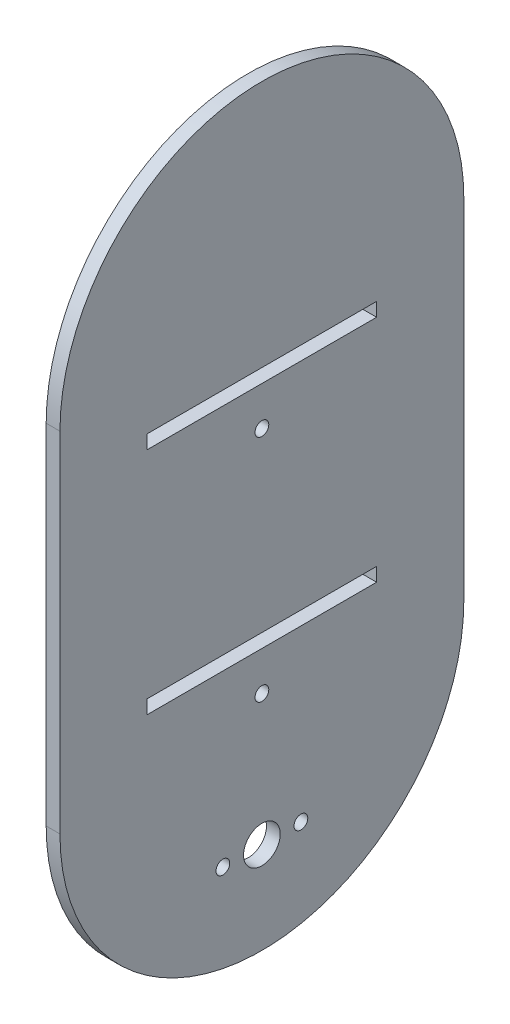
ISO-10303-21;
HEADER;
FILE_DESCRIPTION(('STEP AP214'),'2;1');
FILE_NAME('part.step','',(''),(''),'','','');
FILE_SCHEMA(('AUTOMOTIVE_DESIGN { 1 0 10303 214 1 1 1 1 }'));
ENDSEC;
DATA;
#1=APPLICATION_CONTEXT('core data for automotive mechanical design processes');
#2=APPLICATION_PROTOCOL_DEFINITION('international standard','automotive_design',2000,#1);
#3=PRODUCT_CONTEXT('',#1,'mechanical');
#4=PRODUCT('Part','Part','',(#3));
#5=PRODUCT_RELATED_PRODUCT_CATEGORY('part','',(#4));
#6=PRODUCT_DEFINITION_FORMATION('','',#4);
#7=PRODUCT_DEFINITION_CONTEXT('part definition',#1,'design');
#8=PRODUCT_DEFINITION('design','',#6,#7);
#9=PRODUCT_DEFINITION_SHAPE('','',#8);
#10=(LENGTH_UNIT() NAMED_UNIT(*) SI_UNIT(.MILLI.,.METRE.));
#11=(NAMED_UNIT(*) PLANE_ANGLE_UNIT() SI_UNIT($,.RADIAN.));
#12=(NAMED_UNIT(*) SI_UNIT($,.STERADIAN.) SOLID_ANGLE_UNIT());
#13=UNCERTAINTY_MEASURE_WITH_UNIT(LENGTH_MEASURE(1.E-05),#10,'distance_accuracy_value','');
#14=(GEOMETRIC_REPRESENTATION_CONTEXT(3) GLOBAL_UNCERTAINTY_ASSIGNED_CONTEXT((#13)) GLOBAL_UNIT_ASSIGNED_CONTEXT((#10,
#11,#12)) REPRESENTATION_CONTEXT('',''));
#15=CARTESIAN_POINT('',(0.,0.,0.));
#16=DIRECTION('',(0.,0.,1.));
#17=DIRECTION('',(1.,0.,0.));
#18=AXIS2_PLACEMENT_3D('',#15,#16,#17);
#19=CARTESIAN_POINT('',(3.,0.,0.));
#20=DIRECTION('',(1.,0.,0.));
#21=DIRECTION('',(0.,0.,-1.));
#22=AXIS2_PLACEMENT_3D('',#19,#20,#21);
#23=PLANE('',#22);
#24=CARTESIAN_POINT('',(3.,-100.,8.49999999999997));
#25=DIRECTION('',(1.,0.,0.));
#26=DIRECTION('',(0.,0.,-1.));
#27=AXIS2_PLACEMENT_3D('',#24,#25,#26);
#28=CIRCLE('',#27,1.5);
#29=CARTESIAN_POINT('',(3.,-100.,6.99999999999997));
#30=VERTEX_POINT('',#29);
#31=EDGE_CURVE('E340',#30,#30,#28,.T.);
#32=ORIENTED_EDGE('',*,*,#31,.F.);
#33=EDGE_LOOP('',(#32));
#34=FACE_BOUND('',#33,.T.);
#35=CARTESIAN_POINT('',(3.,-71.5,0.));
#36=DIRECTION('',(1.,0.,0.));
#37=DIRECTION('',(0.,0.,-1.));
#38=AXIS2_PLACEMENT_3D('',#35,#36,#37);
#39=CIRCLE('',#38,1.5);
#40=CARTESIAN_POINT('',(3.,-71.5,-1.50000000000003));
#41=VERTEX_POINT('',#40);
#42=EDGE_CURVE('E352',#41,#41,#39,.T.);
#43=ORIENTED_EDGE('',*,*,#42,.F.);
#44=EDGE_LOOP('',(#43));
#45=FACE_BOUND('',#44,.T.);
#46=DIRECTION('',(0.,0.,1.));
#47=VECTOR('',#46,1.);
#48=CARTESIAN_POINT('',(3.,-60.,25.));
#49=LINE('',#48,#47);
#50=CARTESIAN_POINT('',(3.,-60.,-25.));
#51=VERTEX_POINT('',#50);
#52=CARTESIAN_POINT('',(3.,-60.,25.));
#53=VERTEX_POINT('',#52);
#54=EDGE_CURVE('E139',#51,#53,#49,.T.);
#55=ORIENTED_EDGE('',*,*,#54,.F.);
#56=DIRECTION('',(0.,1.,0.));
#57=VECTOR('',#56,1.);
#58=CARTESIAN_POINT('',(3.,-60.,-25.));
#59=LINE('',#58,#57);
#60=CARTESIAN_POINT('',(3.,-63.,-25.));
#61=VERTEX_POINT('',#60);
#62=EDGE_CURVE('E131',#61,#51,#59,.T.);
#63=ORIENTED_EDGE('',*,*,#62,.F.);
#64=DIRECTION('',(0.,0.,-1.));
#65=VECTOR('',#64,1.);
#66=CARTESIAN_POINT('',(3.,-63.,-25.));
#67=LINE('',#66,#65);
#68=CARTESIAN_POINT('',(3.,-63.,25.));
#69=VERTEX_POINT('',#68);
#70=EDGE_CURVE('E154',#69,#61,#67,.T.);
#71=ORIENTED_EDGE('',*,*,#70,.F.);
#72=DIRECTION('',(0.,-1.,0.));
#73=VECTOR('',#72,1.);
#74=CARTESIAN_POINT('',(3.,-60.,25.));
#75=LINE('',#74,#73);
#76=EDGE_CURVE('E152',#53,#69,#75,.T.);
#77=ORIENTED_EDGE('',*,*,#76,.F.);
#78=EDGE_LOOP('',(#55,#63,#71,#77));
#79=FACE_BOUND('',#78,.T.);
#80=DIRECTION('',(0.,0.,1.));
#81=VECTOR('',#80,1.);
#82=CARTESIAN_POINT('',(3.,-10.,25.));
#83=LINE('',#82,#81);
#84=CARTESIAN_POINT('',(3.,-9.99999999999999,-25.));
#85=VERTEX_POINT('',#84);
#86=CARTESIAN_POINT('',(3.,-10.,25.));
#87=VERTEX_POINT('',#86);
#88=EDGE_CURVE('E172',#85,#87,#83,.T.);
#89=ORIENTED_EDGE('',*,*,#88,.F.);
#90=DIRECTION('',(0.,1.,0.));
#91=VECTOR('',#90,1.);
#92=CARTESIAN_POINT('',(3.,-9.99999999999999,-25.));
#93=LINE('',#92,#91);
#94=CARTESIAN_POINT('',(3.,-13.,-25.));
#95=VERTEX_POINT('',#94);
#96=EDGE_CURVE('E170',#95,#85,#93,.T.);
#97=ORIENTED_EDGE('',*,*,#96,.F.);
#98=DIRECTION('',(0.,0.,-1.));
#99=VECTOR('',#98,1.);
#100=CARTESIAN_POINT('',(3.,-13.,-25.));
#101=LINE('',#100,#99);
#102=CARTESIAN_POINT('',(3.,-13.,25.));
#103=VERTEX_POINT('',#102);
#104=EDGE_CURVE('E178',#103,#95,#101,.T.);
#105=ORIENTED_EDGE('',*,*,#104,.F.);
#106=DIRECTION('',(0.,-1.,0.));
#107=VECTOR('',#106,1.);
#108=CARTESIAN_POINT('',(3.,-10.,25.));
#109=LINE('',#108,#107);
#110=EDGE_CURVE('E175',#87,#103,#109,.T.);
#111=ORIENTED_EDGE('',*,*,#110,.F.);
#112=EDGE_LOOP('',(#89,#97,#105,#111));
#113=FACE_BOUND('',#112,.T.);
#114=CARTESIAN_POINT('',(3.,0.,0.));
#115=DIRECTION('',(1.,0.,0.));
#116=DIRECTION('',(0.,0.,-1.));
#117=AXIS2_PLACEMENT_3D('',#114,#115,#116);
#118=CIRCLE('',#117,44.);
#119=CARTESIAN_POINT('',(3.,0.,-44.));
#120=VERTEX_POINT('',#119);
#121=CARTESIAN_POINT('',(3.,0.,44.));
#122=VERTEX_POINT('',#121);
#123=EDGE_CURVE('E201',#120,#122,#118,.T.);
#124=ORIENTED_EDGE('',*,*,#123,.T.);
#125=DIRECTION('',(0.,-1.,0.));
#126=VECTOR('',#125,1.);
#127=CARTESIAN_POINT('',(3.,0.,44.));
#128=LINE('',#127,#126);
#129=CARTESIAN_POINT('',(3.,-76.,44.));
#130=VERTEX_POINT('',#129);
#131=EDGE_CURVE('E204',#122,#130,#128,.T.);
#132=ORIENTED_EDGE('',*,*,#131,.T.);
#133=CARTESIAN_POINT('',(3.,-76.,0.));
#134=DIRECTION('',(1.,0.,0.));
#135=DIRECTION('',(0.,0.,-1.));
#136=AXIS2_PLACEMENT_3D('',#133,#134,#135);
#137=CIRCLE('',#136,44.);
#138=CARTESIAN_POINT('',(3.,-76.,-44.));
#139=VERTEX_POINT('',#138);
#140=EDGE_CURVE('E207',#130,#139,#137,.T.);
#141=ORIENTED_EDGE('',*,*,#140,.T.);
#142=DIRECTION('',(0.,1.,0.));
#143=VECTOR('',#142,1.);
#144=CARTESIAN_POINT('',(3.,0.,-44.));
#145=LINE('',#144,#143);
#146=EDGE_CURVE('E209',#139,#120,#145,.T.);
#147=ORIENTED_EDGE('',*,*,#146,.T.);
#148=EDGE_LOOP('',(#124,#132,#141,#147));
#149=FACE_BOUND('',#148,.T.);
#150=CARTESIAN_POINT('',(3.,-21.5,0.));
#151=DIRECTION('',(1.,0.,0.));
#152=DIRECTION('',(0.,0.,-1.));
#153=AXIS2_PLACEMENT_3D('',#150,#151,#152);
#154=CIRCLE('',#153,1.5);
#155=CARTESIAN_POINT('',(3.,-21.5,-1.50000000000003));
#156=VERTEX_POINT('',#155);
#157=EDGE_CURVE('E160',#156,#156,#154,.T.);
#158=ORIENTED_EDGE('',*,*,#157,.F.);
#159=EDGE_LOOP('',(#158));
#160=FACE_BOUND('',#159,.T.);
#161=CARTESIAN_POINT('',(3.,-100.,0.));
#162=DIRECTION('',(1.,0.,0.));
#163=DIRECTION('',(0.,0.,-1.));
#164=AXIS2_PLACEMENT_3D('',#161,#162,#163);
#165=CIRCLE('',#164,4.);
#166=CARTESIAN_POINT('',(3.,-100.,-4.));
#167=VERTEX_POINT('',#166);
#168=EDGE_CURVE('E346',#167,#167,#165,.T.);
#169=ORIENTED_EDGE('',*,*,#168,.F.);
#170=EDGE_LOOP('',(#169));
#171=FACE_BOUND('',#170,.T.);
#172=CARTESIAN_POINT('',(3.,-100.,-8.49999999999997));
#173=DIRECTION('',(1.,0.,0.));
#174=DIRECTION('',(0.,0.,1.));
#175=AXIS2_PLACEMENT_3D('',#172,#173,#174);
#176=CIRCLE('',#175,1.5);
#177=CARTESIAN_POINT('',(3.,-100.,-6.99999999999997));
#178=VERTEX_POINT('',#177);
#179=EDGE_CURVE('E331',#178,#178,#176,.T.);
#180=ORIENTED_EDGE('',*,*,#179,.F.);
#181=EDGE_LOOP('',(#180));
#182=FACE_BOUND('',#181,.T.);
#183=ADVANCED_FACE('F42',(#34,#45,#79,#113,#149,#160,#171,#182),#23,.T.);
#184=CARTESIAN_POINT('',(0.,0.,0.));
#185=DIRECTION('',(1.,0.,0.));
#186=DIRECTION('',(0.,0.,-1.));
#187=AXIS2_PLACEMENT_3D('',#184,#185,#186);
#188=PLANE('',#187);
#189=DIRECTION('',(0.,1.,0.));
#190=VECTOR('',#189,1.);
#191=CARTESIAN_POINT('',(0.,-9.99999999999999,-25.));
#192=LINE('',#191,#190);
#193=CARTESIAN_POINT('',(0.,-13.,-25.));
#194=VERTEX_POINT('',#193);
#195=CARTESIAN_POINT('',(0.,-9.99999999999999,-25.));
#196=VERTEX_POINT('',#195);
#197=EDGE_CURVE('E147',#194,#196,#192,.T.);
#198=ORIENTED_EDGE('',*,*,#197,.T.);
#199=DIRECTION('',(0.,0.,1.));
#200=VECTOR('',#199,1.);
#201=CARTESIAN_POINT('',(0.,-10.,25.));
#202=LINE('',#201,#200);
#203=CARTESIAN_POINT('',(0.,-10.,25.));
#204=VERTEX_POINT('',#203);
#205=EDGE_CURVE('E183',#196,#204,#202,.T.);
#206=ORIENTED_EDGE('',*,*,#205,.T.);
#207=DIRECTION('',(0.,-1.,0.));
#208=VECTOR('',#207,1.);
#209=CARTESIAN_POINT('',(0.,-10.,25.));
#210=LINE('',#209,#208);
#211=CARTESIAN_POINT('',(0.,-13.,25.));
#212=VERTEX_POINT('',#211);
#213=EDGE_CURVE('E186',#204,#212,#210,.T.);
#214=ORIENTED_EDGE('',*,*,#213,.T.);
#215=DIRECTION('',(0.,0.,-1.));
#216=VECTOR('',#215,1.);
#217=CARTESIAN_POINT('',(0.,-13.,-25.));
#218=LINE('',#217,#216);
#219=EDGE_CURVE('E173',#212,#194,#218,.T.);
#220=ORIENTED_EDGE('',*,*,#219,.T.);
#221=EDGE_LOOP('',(#198,#206,#214,#220));
#222=FACE_BOUND('',#221,.T.);
#223=CARTESIAN_POINT('',(0.,0.,0.));
#224=DIRECTION('',(1.,0.,0.));
#225=DIRECTION('',(0.,0.,-1.));
#226=AXIS2_PLACEMENT_3D('',#223,#224,#225);
#227=CIRCLE('',#226,44.);
#228=CARTESIAN_POINT('',(0.,0.,-44.));
#229=VERTEX_POINT('',#228);
#230=CARTESIAN_POINT('',(0.,0.,44.));
#231=VERTEX_POINT('',#230);
#232=EDGE_CURVE('E200',#229,#231,#227,.T.);
#233=ORIENTED_EDGE('',*,*,#232,.F.);
#234=DIRECTION('',(0.,1.,0.));
#235=VECTOR('',#234,1.);
#236=CARTESIAN_POINT('',(0.,0.,-44.));
#237=LINE('',#236,#235);
#238=CARTESIAN_POINT('',(0.,-76.,-44.));
#239=VERTEX_POINT('',#238);
#240=EDGE_CURVE('E205',#239,#229,#237,.T.);
#241=ORIENTED_EDGE('',*,*,#240,.F.);
#242=CARTESIAN_POINT('',(0.,-76.,0.));
#243=DIRECTION('',(1.,0.,0.));
#244=DIRECTION('',(0.,0.,-1.));
#245=AXIS2_PLACEMENT_3D('',#242,#243,#244);
#246=CIRCLE('',#245,44.);
#247=CARTESIAN_POINT('',(0.,-76.,44.));
#248=VERTEX_POINT('',#247);
#249=EDGE_CURVE('E216',#248,#239,#246,.T.);
#250=ORIENTED_EDGE('',*,*,#249,.F.);
#251=DIRECTION('',(0.,-1.,0.));
#252=VECTOR('',#251,1.);
#253=CARTESIAN_POINT('',(0.,0.,44.));
#254=LINE('',#253,#252);
#255=EDGE_CURVE('E214',#231,#248,#254,.T.);
#256=ORIENTED_EDGE('',*,*,#255,.F.);
#257=EDGE_LOOP('',(#233,#241,#250,#256));
#258=FACE_BOUND('',#257,.T.);
#259=DIRECTION('',(0.,1.,0.));
#260=VECTOR('',#259,1.);
#261=CARTESIAN_POINT('',(0.,-60.,-25.));
#262=LINE('',#261,#260);
#263=CARTESIAN_POINT('',(0.,-63.,-25.));
#264=VERTEX_POINT('',#263);
#265=CARTESIAN_POINT('',(0.,-60.,-25.));
#266=VERTEX_POINT('',#265);
#267=EDGE_CURVE('E65',#264,#266,#262,.T.);
#268=ORIENTED_EDGE('',*,*,#267,.T.);
#269=DIRECTION('',(0.,0.,1.));
#270=VECTOR('',#269,1.);
#271=CARTESIAN_POINT('',(0.,-60.,25.));
#272=LINE('',#271,#270);
#273=CARTESIAN_POINT('',(0.,-60.,25.));
#274=VERTEX_POINT('',#273);
#275=EDGE_CURVE('E146',#266,#274,#272,.T.);
#276=ORIENTED_EDGE('',*,*,#275,.T.);
#277=DIRECTION('',(0.,-1.,0.));
#278=VECTOR('',#277,1.);
#279=CARTESIAN_POINT('',(0.,-60.,25.));
#280=LINE('',#279,#278);
#281=CARTESIAN_POINT('',(0.,-63.,25.));
#282=VERTEX_POINT('',#281);
#283=EDGE_CURVE('E162',#274,#282,#280,.T.);
#284=ORIENTED_EDGE('',*,*,#283,.T.);
#285=DIRECTION('',(0.,0.,-1.));
#286=VECTOR('',#285,1.);
#287=CARTESIAN_POINT('',(0.,-63.,-25.));
#288=LINE('',#287,#286);
#289=EDGE_CURVE('E140',#282,#264,#288,.T.);
#290=ORIENTED_EDGE('',*,*,#289,.T.);
#291=EDGE_LOOP('',(#268,#276,#284,#290));
#292=FACE_BOUND('',#291,.T.);
#293=CARTESIAN_POINT('',(0.,-21.5,0.));
#294=DIRECTION('',(1.,0.,0.));
#295=DIRECTION('',(0.,0.,-1.));
#296=AXIS2_PLACEMENT_3D('',#293,#294,#295);
#297=CIRCLE('',#296,1.5);
#298=CARTESIAN_POINT('',(0.,-21.5,-1.50000000000003));
#299=VERTEX_POINT('',#298);
#300=EDGE_CURVE('E355',#299,#299,#297,.T.);
#301=ORIENTED_EDGE('',*,*,#300,.T.);
#302=EDGE_LOOP('',(#301));
#303=FACE_BOUND('',#302,.T.);
#304=CARTESIAN_POINT('',(0.,-71.5,0.));
#305=DIRECTION('',(1.,0.,0.));
#306=DIRECTION('',(0.,0.,-1.));
#307=AXIS2_PLACEMENT_3D('',#304,#305,#306);
#308=CIRCLE('',#307,1.5);
#309=CARTESIAN_POINT('',(0.,-71.5,-1.50000000000003));
#310=VERTEX_POINT('',#309);
#311=EDGE_CURVE('E349',#310,#310,#308,.T.);
#312=ORIENTED_EDGE('',*,*,#311,.T.);
#313=EDGE_LOOP('',(#312));
#314=FACE_BOUND('',#313,.T.);
#315=CARTESIAN_POINT('',(0.,-100.,0.));
#316=DIRECTION('',(1.,0.,0.));
#317=DIRECTION('',(0.,0.,-1.));
#318=AXIS2_PLACEMENT_3D('',#315,#316,#317);
#319=CIRCLE('',#318,4.);
#320=CARTESIAN_POINT('',(0.,-100.,-4.));
#321=VERTEX_POINT('',#320);
#322=EDGE_CURVE('E343',#321,#321,#319,.T.);
#323=ORIENTED_EDGE('',*,*,#322,.T.);
#324=EDGE_LOOP('',(#323));
#325=FACE_BOUND('',#324,.T.);
#326=CARTESIAN_POINT('',(0.,-100.,8.49999999999997));
#327=DIRECTION('',(1.,0.,0.));
#328=DIRECTION('',(0.,0.,-1.));
#329=AXIS2_PLACEMENT_3D('',#326,#327,#328);
#330=CIRCLE('',#329,1.5);
#331=CARTESIAN_POINT('',(0.,-100.,6.99999999999997));
#332=VERTEX_POINT('',#331);
#333=EDGE_CURVE('E337',#332,#332,#330,.T.);
#334=ORIENTED_EDGE('',*,*,#333,.T.);
#335=EDGE_LOOP('',(#334));
#336=FACE_BOUND('',#335,.T.);
#337=CARTESIAN_POINT('',(0.,-100.,-8.49999999999997));
#338=DIRECTION('',(1.,0.,0.));
#339=DIRECTION('',(0.,0.,1.));
#340=AXIS2_PLACEMENT_3D('',#337,#338,#339);
#341=CIRCLE('',#340,1.5);
#342=CARTESIAN_POINT('',(0.,-100.,-6.99999999999997));
#343=VERTEX_POINT('',#342);
#344=EDGE_CURVE('E334',#343,#343,#341,.T.);
#345=ORIENTED_EDGE('',*,*,#344,.T.);
#346=EDGE_LOOP('',(#345));
#347=FACE_BOUND('',#346,.T.);
#348=ADVANCED_FACE('F234',(#222,#258,#292,#303,#314,#325,#336,#347),#188,.F.);
#349=CARTESIAN_POINT('',(3.,0.,0.));
#350=DIRECTION('',(-1.,0.,0.));
#351=DIRECTION('',(0.,0.,1.));
#352=AXIS2_PLACEMENT_3D('',#349,#350,#351);
#353=CYLINDRICAL_SURFACE('',#352,44.);
#354=ORIENTED_EDGE('',*,*,#232,.T.);
#355=DIRECTION('',(-1.,0.,0.));
#356=VECTOR('',#355,1.);
#357=CARTESIAN_POINT('',(3.,0.,44.));
#358=LINE('',#357,#356);
#359=EDGE_CURVE('E13',#122,#231,#358,.T.);
#360=ORIENTED_EDGE('',*,*,#359,.F.);
#361=ORIENTED_EDGE('',*,*,#123,.F.);
#362=DIRECTION('',(-1.,0.,0.));
#363=VECTOR('',#362,1.);
#364=CARTESIAN_POINT('',(3.,0.,-44.));
#365=LINE('',#364,#363);
#366=EDGE_CURVE('E211',#120,#229,#365,.T.);
#367=ORIENTED_EDGE('',*,*,#366,.T.);
#368=EDGE_LOOP('',(#354,#360,#361,#367));
#369=FACE_BOUND('',#368,.T.);
#370=ADVANCED_FACE('F44',(#369),#353,.T.);
#371=CARTESIAN_POINT('',(3.,0.,44.));
#372=DIRECTION('',(0.,0.,-1.));
#373=DIRECTION('',(-1.,0.,0.));
#374=AXIS2_PLACEMENT_3D('',#371,#372,#373);
#375=PLANE('',#374);
#376=ORIENTED_EDGE('',*,*,#255,.T.);
#377=DIRECTION('',(-1.,0.,0.));
#378=VECTOR('',#377,1.);
#379=CARTESIAN_POINT('',(3.,-76.,44.));
#380=LINE('',#379,#378);
#381=EDGE_CURVE('E50',#130,#248,#380,.T.);
#382=ORIENTED_EDGE('',*,*,#381,.F.);
#383=ORIENTED_EDGE('',*,*,#131,.F.);
#384=ORIENTED_EDGE('',*,*,#359,.T.);
#385=EDGE_LOOP('',(#376,#382,#383,#384));
#386=FACE_BOUND('',#385,.T.);
#387=ADVANCED_FACE('F245',(#386),#375,.F.);
#388=CARTESIAN_POINT('',(3.,-76.,0.));
#389=DIRECTION('',(-1.,0.,0.));
#390=DIRECTION('',(0.,0.,1.));
#391=AXIS2_PLACEMENT_3D('',#388,#389,#390);
#392=CYLINDRICAL_SURFACE('',#391,44.);
#393=ORIENTED_EDGE('',*,*,#249,.T.);
#394=DIRECTION('',(-1.,0.,0.));
#395=VECTOR('',#394,1.);
#396=CARTESIAN_POINT('',(3.,-76.,-44.));
#397=LINE('',#396,#395);
#398=EDGE_CURVE('E221',#139,#239,#397,.T.);
#399=ORIENTED_EDGE('',*,*,#398,.F.);
#400=ORIENTED_EDGE('',*,*,#140,.F.);
#401=ORIENTED_EDGE('',*,*,#381,.T.);
#402=EDGE_LOOP('',(#393,#399,#400,#401));
#403=FACE_BOUND('',#402,.T.);
#404=ADVANCED_FACE('F228',(#403),#392,.T.);
#405=CARTESIAN_POINT('',(3.,0.,-44.));
#406=DIRECTION('',(0.,0.,1.));
#407=DIRECTION('',(0.,-1.,0.));
#408=AXIS2_PLACEMENT_3D('',#405,#406,#407);
#409=PLANE('',#408);
#410=ORIENTED_EDGE('',*,*,#240,.T.);
#411=ORIENTED_EDGE('',*,*,#366,.F.);
#412=ORIENTED_EDGE('',*,*,#146,.F.);
#413=ORIENTED_EDGE('',*,*,#398,.T.);
#414=EDGE_LOOP('',(#410,#411,#412,#413));
#415=FACE_BOUND('',#414,.T.);
#416=ADVANCED_FACE('F238',(#415),#409,.F.);
#417=CARTESIAN_POINT('',(3.,-9.99999999999999,-25.));
#418=DIRECTION('',(0.,0.,1.));
#419=DIRECTION('',(0.,-1.,0.));
#420=AXIS2_PLACEMENT_3D('',#417,#418,#419);
#421=PLANE('',#420);
#422=ORIENTED_EDGE('',*,*,#197,.F.);
#423=DIRECTION('',(-1.,0.,0.));
#424=VECTOR('',#423,1.);
#425=CARTESIAN_POINT('',(3.,-13.,-25.));
#426=LINE('',#425,#424);
#427=EDGE_CURVE('E180',#95,#194,#426,.T.);
#428=ORIENTED_EDGE('',*,*,#427,.F.);
#429=ORIENTED_EDGE('',*,*,#96,.T.);
#430=DIRECTION('',(-1.,0.,0.));
#431=VECTOR('',#430,1.);
#432=CARTESIAN_POINT('',(3.,-9.99999999999999,-25.));
#433=LINE('',#432,#431);
#434=EDGE_CURVE('E197',#85,#196,#433,.T.);
#435=ORIENTED_EDGE('',*,*,#434,.T.);
#436=EDGE_LOOP('',(#422,#428,#429,#435));
#437=FACE_BOUND('',#436,.T.);
#438=ADVANCED_FACE('F263',(#437),#421,.T.);
#439=CARTESIAN_POINT('',(3.,-10.,25.));
#440=DIRECTION('',(0.,-1.,0.));
#441=DIRECTION('',(0.,0.,-1.));
#442=AXIS2_PLACEMENT_3D('',#439,#440,#441);
#443=PLANE('',#442);
#444=ORIENTED_EDGE('',*,*,#205,.F.);
#445=ORIENTED_EDGE('',*,*,#434,.F.);
#446=ORIENTED_EDGE('',*,*,#88,.T.);
#447=DIRECTION('',(-1.,0.,0.));
#448=VECTOR('',#447,1.);
#449=CARTESIAN_POINT('',(3.,-10.,25.));
#450=LINE('',#449,#448);
#451=EDGE_CURVE('E195',#87,#204,#450,.T.);
#452=ORIENTED_EDGE('',*,*,#451,.T.);
#453=EDGE_LOOP('',(#444,#445,#446,#452));
#454=FACE_BOUND('',#453,.T.);
#455=ADVANCED_FACE('F270',(#454),#443,.T.);
#456=CARTESIAN_POINT('',(3.,-10.,25.));
#457=DIRECTION('',(0.,0.,-1.));
#458=DIRECTION('',(0.,1.,0.));
#459=AXIS2_PLACEMENT_3D('',#456,#457,#458);
#460=PLANE('',#459);
#461=ORIENTED_EDGE('',*,*,#213,.F.);
#462=ORIENTED_EDGE('',*,*,#451,.F.);
#463=ORIENTED_EDGE('',*,*,#110,.T.);
#464=DIRECTION('',(-1.,0.,0.));
#465=VECTOR('',#464,1.);
#466=CARTESIAN_POINT('',(3.,-13.,25.));
#467=LINE('',#466,#465);
#468=EDGE_CURVE('E193',#103,#212,#467,.T.);
#469=ORIENTED_EDGE('',*,*,#468,.T.);
#470=EDGE_LOOP('',(#461,#462,#463,#469));
#471=FACE_BOUND('',#470,.T.);
#472=ADVANCED_FACE('F275',(#471),#460,.T.);
#473=CARTESIAN_POINT('',(3.,-13.,-25.));
#474=DIRECTION('',(0.,1.,0.));
#475=DIRECTION('',(0.,0.,1.));
#476=AXIS2_PLACEMENT_3D('',#473,#474,#475);
#477=PLANE('',#476);
#478=ORIENTED_EDGE('',*,*,#219,.F.);
#479=ORIENTED_EDGE('',*,*,#468,.F.);
#480=ORIENTED_EDGE('',*,*,#104,.T.);
#481=ORIENTED_EDGE('',*,*,#427,.T.);
#482=EDGE_LOOP('',(#478,#479,#480,#481));
#483=FACE_BOUND('',#482,.T.);
#484=ADVANCED_FACE('F282',(#483),#477,.T.);
#485=CARTESIAN_POINT('',(3.,-60.,-25.));
#486=DIRECTION('',(0.,0.,1.));
#487=DIRECTION('',(1.,0.,0.));
#488=AXIS2_PLACEMENT_3D('',#485,#486,#487);
#489=PLANE('',#488);
#490=ORIENTED_EDGE('',*,*,#267,.F.);
#491=DIRECTION('',(-1.,0.,0.));
#492=VECTOR('',#491,1.);
#493=CARTESIAN_POINT('',(3.,-63.,-25.));
#494=LINE('',#493,#492);
#495=EDGE_CURVE('E135',#61,#264,#494,.T.);
#496=ORIENTED_EDGE('',*,*,#495,.F.);
#497=ORIENTED_EDGE('',*,*,#62,.T.);
#498=DIRECTION('',(-1.,0.,0.));
#499=VECTOR('',#498,1.);
#500=CARTESIAN_POINT('',(3.,-60.,-25.));
#501=LINE('',#500,#499);
#502=EDGE_CURVE('E134',#51,#266,#501,.T.);
#503=ORIENTED_EDGE('',*,*,#502,.T.);
#504=EDGE_LOOP('',(#490,#496,#497,#503));
#505=FACE_BOUND('',#504,.T.);
#506=ADVANCED_FACE('F133',(#505),#489,.T.);
#507=CARTESIAN_POINT('',(3.,-60.,25.));
#508=DIRECTION('',(0.,-1.,0.));
#509=DIRECTION('',(0.,0.,-1.));
#510=AXIS2_PLACEMENT_3D('',#507,#508,#509);
#511=PLANE('',#510);
#512=ORIENTED_EDGE('',*,*,#275,.F.);
#513=ORIENTED_EDGE('',*,*,#502,.F.);
#514=ORIENTED_EDGE('',*,*,#54,.T.);
#515=DIRECTION('',(-1.,0.,0.));
#516=VECTOR('',#515,1.);
#517=CARTESIAN_POINT('',(3.,-60.,25.));
#518=LINE('',#517,#516);
#519=EDGE_CURVE('E148',#53,#274,#518,.T.);
#520=ORIENTED_EDGE('',*,*,#519,.T.);
#521=EDGE_LOOP('',(#512,#513,#514,#520));
#522=FACE_BOUND('',#521,.T.);
#523=ADVANCED_FACE('F143',(#522),#511,.T.);
#524=CARTESIAN_POINT('',(3.,-60.,25.));
#525=DIRECTION('',(0.,0.,-1.));
#526=DIRECTION('',(-1.,0.,0.));
#527=AXIS2_PLACEMENT_3D('',#524,#525,#526);
#528=PLANE('',#527);
#529=ORIENTED_EDGE('',*,*,#283,.F.);
#530=ORIENTED_EDGE('',*,*,#519,.F.);
#531=ORIENTED_EDGE('',*,*,#76,.T.);
#532=DIRECTION('',(-1.,0.,0.));
#533=VECTOR('',#532,1.);
#534=CARTESIAN_POINT('',(3.,-63.,25.));
#535=LINE('',#534,#533);
#536=EDGE_CURVE('E57',#69,#282,#535,.T.);
#537=ORIENTED_EDGE('',*,*,#536,.T.);
#538=EDGE_LOOP('',(#529,#530,#531,#537));
#539=FACE_BOUND('',#538,.T.);
#540=ADVANCED_FACE('F300',(#539),#528,.T.);
#541=CARTESIAN_POINT('',(3.,-63.,-25.));
#542=DIRECTION('',(0.,1.,0.));
#543=DIRECTION('',(0.,0.,1.));
#544=AXIS2_PLACEMENT_3D('',#541,#542,#543);
#545=PLANE('',#544);
#546=ORIENTED_EDGE('',*,*,#289,.F.);
#547=ORIENTED_EDGE('',*,*,#536,.F.);
#548=ORIENTED_EDGE('',*,*,#70,.T.);
#549=ORIENTED_EDGE('',*,*,#495,.T.);
#550=EDGE_LOOP('',(#546,#547,#548,#549));
#551=FACE_BOUND('',#550,.T.);
#552=ADVANCED_FACE('F303',(#551),#545,.T.);
#553=CARTESIAN_POINT('',(3.,-21.5,0.));
#554=DIRECTION('',(-1.,0.,0.));
#555=DIRECTION('',(0.,0.,1.));
#556=AXIS2_PLACEMENT_3D('',#553,#554,#555);
#557=CYLINDRICAL_SURFACE('',#556,1.5);
#558=ORIENTED_EDGE('',*,*,#157,.T.);
#559=EDGE_LOOP('',(#558));
#560=FACE_BOUND('',#559,.T.);
#561=ORIENTED_EDGE('',*,*,#300,.F.);
#562=EDGE_LOOP('',(#561));
#563=FACE_BOUND('',#562,.T.);
#564=ADVANCED_FACE('F307',(#560,#563),#557,.F.);
#565=CARTESIAN_POINT('',(3.,-71.5,0.));
#566=DIRECTION('',(-1.,0.,0.));
#567=DIRECTION('',(0.,0.,1.));
#568=AXIS2_PLACEMENT_3D('',#565,#566,#567);
#569=CYLINDRICAL_SURFACE('',#568,1.5);
#570=ORIENTED_EDGE('',*,*,#42,.T.);
#571=EDGE_LOOP('',(#570));
#572=FACE_BOUND('',#571,.T.);
#573=ORIENTED_EDGE('',*,*,#311,.F.);
#574=EDGE_LOOP('',(#573));
#575=FACE_BOUND('',#574,.T.);
#576=ADVANCED_FACE('F310',(#572,#575),#569,.F.);
#577=CARTESIAN_POINT('',(3.,-100.,0.));
#578=DIRECTION('',(-1.,0.,0.));
#579=DIRECTION('',(0.,0.,1.));
#580=AXIS2_PLACEMENT_3D('',#577,#578,#579);
#581=CYLINDRICAL_SURFACE('',#580,4.);
#582=ORIENTED_EDGE('',*,*,#168,.T.);
#583=EDGE_LOOP('',(#582));
#584=FACE_BOUND('',#583,.T.);
#585=ORIENTED_EDGE('',*,*,#322,.F.);
#586=EDGE_LOOP('',(#585));
#587=FACE_BOUND('',#586,.T.);
#588=ADVANCED_FACE('F314',(#584,#587),#581,.F.);
#589=CARTESIAN_POINT('',(3.,-100.,8.49999999999997));
#590=DIRECTION('',(-1.,0.,0.));
#591=DIRECTION('',(0.,0.,1.));
#592=AXIS2_PLACEMENT_3D('',#589,#590,#591);
#593=CYLINDRICAL_SURFACE('',#592,1.5);
#594=ORIENTED_EDGE('',*,*,#31,.T.);
#595=EDGE_LOOP('',(#594));
#596=FACE_BOUND('',#595,.T.);
#597=ORIENTED_EDGE('',*,*,#333,.F.);
#598=EDGE_LOOP('',(#597));
#599=FACE_BOUND('',#598,.T.);
#600=ADVANCED_FACE('F318',(#596,#599),#593,.F.);
#601=CARTESIAN_POINT('',(3.,-100.,-8.49999999999997));
#602=DIRECTION('',(-1.,0.,0.));
#603=DIRECTION('',(0.,0.,1.));
#604=AXIS2_PLACEMENT_3D('',#601,#602,#603);
#605=CYLINDRICAL_SURFACE('',#604,1.5);
#606=ORIENTED_EDGE('',*,*,#179,.T.);
#607=EDGE_LOOP('',(#606));
#608=FACE_BOUND('',#607,.T.);
#609=ORIENTED_EDGE('',*,*,#344,.F.);
#610=EDGE_LOOP('',(#609));
#611=FACE_BOUND('',#610,.T.);
#612=ADVANCED_FACE('F322',(#608,#611),#605,.F.);
#613=CLOSED_SHELL('',(#183,#348,#370,#387,#404,#416,#438,#455,#472,#484,#506,#523,#540,#552,
#564,#576,#588,#600,#612));
#614=MANIFOLD_SOLID_BREP('B2',#613);
#615=ADVANCED_BREP_SHAPE_REPRESENTATION('',(#18,#614),#14);
#616=SHAPE_DEFINITION_REPRESENTATION(#9,#615);
ENDSEC;
END-ISO-10303-21;
